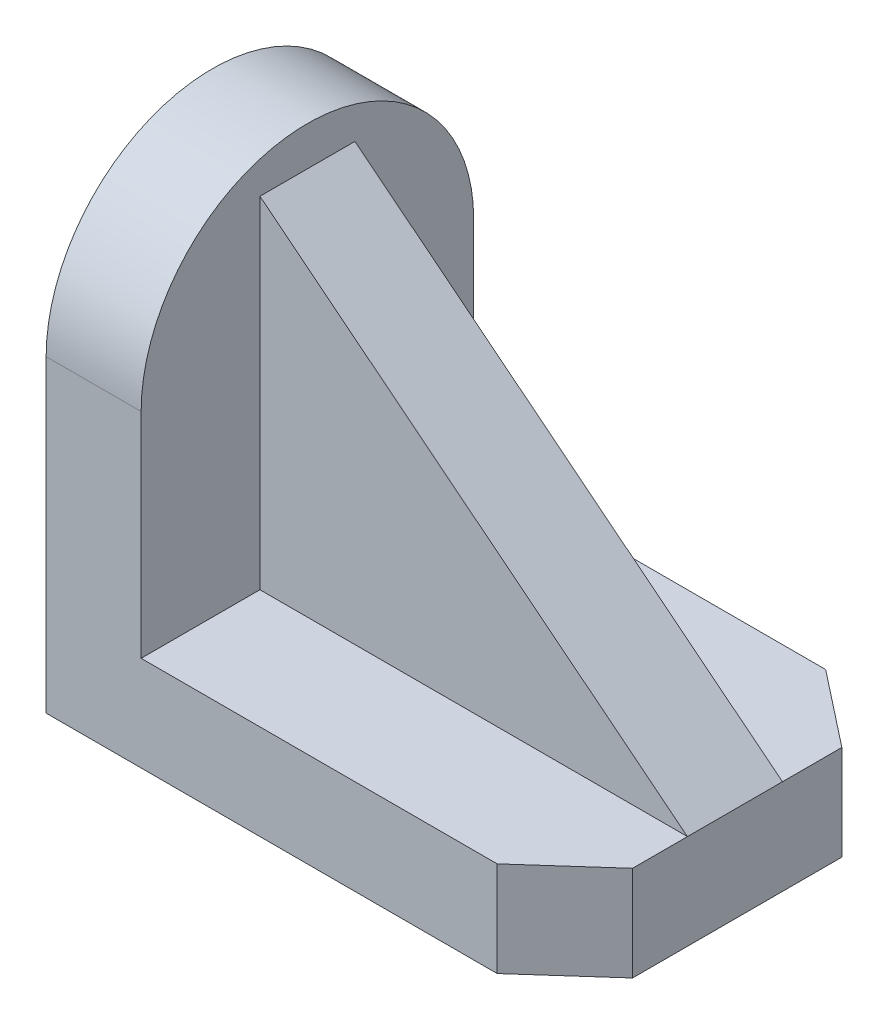
ISO-10303-21;
HEADER;
FILE_DESCRIPTION(('STEP AP214'),'2;1');
FILE_NAME('part.step','',(''),(''),'','','');
FILE_SCHEMA(('AUTOMOTIVE_DESIGN { 1 0 10303 214 1 1 1 1 }'));
ENDSEC;
DATA;
#1=APPLICATION_CONTEXT('core data for automotive mechanical design processes');
#2=APPLICATION_PROTOCOL_DEFINITION('international standard','automotive_design',2000,#1);
#3=PRODUCT_CONTEXT('',#1,'mechanical');
#4=PRODUCT('Part','Part','',(#3));
#5=PRODUCT_RELATED_PRODUCT_CATEGORY('part','',(#4));
#6=PRODUCT_DEFINITION_FORMATION('','',#4);
#7=PRODUCT_DEFINITION_CONTEXT('part definition',#1,'design');
#8=PRODUCT_DEFINITION('design','',#6,#7);
#9=PRODUCT_DEFINITION_SHAPE('','',#8);
#10=(LENGTH_UNIT() NAMED_UNIT(*) SI_UNIT(.MILLI.,.METRE.));
#11=(NAMED_UNIT(*) PLANE_ANGLE_UNIT() SI_UNIT($,.RADIAN.));
#12=(NAMED_UNIT(*) SI_UNIT($,.STERADIAN.) SOLID_ANGLE_UNIT());
#13=UNCERTAINTY_MEASURE_WITH_UNIT(LENGTH_MEASURE(1.E-05),#10,'distance_accuracy_value','');
#14=(GEOMETRIC_REPRESENTATION_CONTEXT(3) GLOBAL_UNCERTAINTY_ASSIGNED_CONTEXT((#13)) GLOBAL_UNIT_ASSIGNED_CONTEXT((#10,
#11,#12)) REPRESENTATION_CONTEXT('',''));
#15=CARTESIAN_POINT('',(0.,0.,0.));
#16=DIRECTION('',(0.,0.,1.));
#17=DIRECTION('',(1.,0.,0.));
#18=AXIS2_PLACEMENT_3D('',#15,#16,#17);
#19=CARTESIAN_POINT('',(0.,12.,0.));
#20=DIRECTION('',(0.,-1.,0.));
#21=DIRECTION('',(0.,0.,-1.));
#22=AXIS2_PLACEMENT_3D('',#19,#20,#21);
#23=PLANE('',#22);
#24=DIRECTION('',(1.,0.,0.));
#25=VECTOR('',#24,1.);
#26=CARTESIAN_POINT('',(-33.,12.,21.));
#27=LINE('',#26,#25);
#28=CARTESIAN_POINT('',(-21.,12.,21.));
#29=VERTEX_POINT('',#28);
#30=CARTESIAN_POINT('',(23.9653566140657,12.,21.));
#31=VERTEX_POINT('',#30);
#32=EDGE_CURVE('E159',#29,#31,#27,.T.);
#33=ORIENTED_EDGE('',*,*,#32,.T.);
#34=DIRECTION('',(-0.746037184688206,0.,0.665904286712809));
#35=VECTOR('',#34,1.);
#36=CARTESIAN_POINT('',(23.9653566140657,12.,21.));
#37=LINE('',#36,#35);
#38=CARTESIAN_POINT('',(33.,12.,12.9357803027881));
#39=VERTEX_POINT('',#38);
#40=EDGE_CURVE('E121',#39,#31,#37,.T.);
#41=ORIENTED_EDGE('',*,*,#40,.F.);
#42=DIRECTION('',(0.,0.,1.));
#43=VECTOR('',#42,1.);
#44=CARTESIAN_POINT('',(33.,12.,-21.));
#45=LINE('',#44,#43);
#46=CARTESIAN_POINT('',(33.,12.,6.));
#47=VERTEX_POINT('',#46);
#48=EDGE_CURVE('E130',#47,#39,#45,.T.);
#49=ORIENTED_EDGE('',*,*,#48,.F.);
#50=DIRECTION('',(1.,0.,0.));
#51=VECTOR('',#50,1.);
#52=CARTESIAN_POINT('',(33.,12.,6.));
#53=LINE('',#52,#51);
#54=CARTESIAN_POINT('',(-21.,12.,6.));
#55=VERTEX_POINT('',#54);
#56=EDGE_CURVE('E181',#55,#47,#53,.T.);
#57=ORIENTED_EDGE('',*,*,#56,.F.);
#58=DIRECTION('',(0.,0.,-1.));
#59=VECTOR('',#58,1.);
#60=CARTESIAN_POINT('',(-21.,12.,-21.));
#61=LINE('',#60,#59);
#62=EDGE_CURVE('E209',#29,#55,#61,.T.);
#63=ORIENTED_EDGE('',*,*,#62,.F.);
#64=EDGE_LOOP('',(#33,#41,#49,#57,#63));
#65=FACE_BOUND('',#64,.T.);
#66=ADVANCED_FACE('F33',(#65),#23,.F.);
#67=CARTESIAN_POINT('',(-21.,38.9950424980755,-21.));
#68=DIRECTION('',(-1.,0.,0.));
#69=DIRECTION('',(0.,0.,1.));
#70=AXIS2_PLACEMENT_3D('',#67,#68,#69);
#71=PLANE('',#70);
#72=DIRECTION('',(0.,-1.,0.));
#73=VECTOR('',#72,1.);
#74=CARTESIAN_POINT('',(-21.,12.,6.));
#75=LINE('',#74,#73);
#76=CARTESIAN_POINT('',(-21.,55.038969320595,6.));
#77=VERTEX_POINT('',#76);
#78=EDGE_CURVE('E187',#77,#55,#75,.T.);
#79=ORIENTED_EDGE('',*,*,#78,.F.);
#80=DIRECTION('',(0.,0.,-1.));
#81=VECTOR('',#80,1.);
#82=CARTESIAN_POINT('',(-21.,55.038969320595,6.));
#83=LINE('',#82,#81);
#84=CARTESIAN_POINT('',(-21.,55.038969320595,-6.));
#85=VERTEX_POINT('',#84);
#86=EDGE_CURVE('E189',#77,#85,#83,.T.);
#87=ORIENTED_EDGE('',*,*,#86,.T.);
#88=DIRECTION('',(0.,-1.,0.));
#89=VECTOR('',#88,1.);
#90=CARTESIAN_POINT('',(-21.,12.,-6.));
#91=LINE('',#90,#89);
#92=CARTESIAN_POINT('',(-21.,12.,-6.));
#93=VERTEX_POINT('',#92);
#94=EDGE_CURVE('E185',#85,#93,#91,.T.);
#95=ORIENTED_EDGE('',*,*,#94,.T.);
#96=CARTESIAN_POINT('',(-21.,12.,-21.));
#97=VERTEX_POINT('',#96);
#98=EDGE_CURVE('E204',#93,#97,#61,.T.);
#99=ORIENTED_EDGE('',*,*,#98,.T.);
#100=DIRECTION('',(0.,-1.,0.));
#101=VECTOR('',#100,1.);
#102=CARTESIAN_POINT('',(-21.,38.9950424980755,-21.));
#103=LINE('',#102,#101);
#104=CARTESIAN_POINT('',(-21.,38.9950424980755,-21.));
#105=VERTEX_POINT('',#104);
#106=EDGE_CURVE('E211',#105,#97,#103,.T.);
#107=ORIENTED_EDGE('',*,*,#106,.F.);
#108=CARTESIAN_POINT('',(-21.,38.9950424980755,0.));
#109=DIRECTION('',(1.,0.,0.));
#110=DIRECTION('',(0.,0.,-1.));
#111=AXIS2_PLACEMENT_3D('',#108,#109,#110);
#112=CIRCLE('',#111,21.);
#113=CARTESIAN_POINT('',(-21.,38.9950424980755,21.));
#114=VERTEX_POINT('',#113);
#115=EDGE_CURVE('E201',#105,#114,#112,.T.);
#116=ORIENTED_EDGE('',*,*,#115,.T.);
#117=DIRECTION('',(0.,-1.,0.));
#118=VECTOR('',#117,1.);
#119=CARTESIAN_POINT('',(-21.,38.9950424980755,21.));
#120=LINE('',#119,#118);
#121=EDGE_CURVE('E141',#114,#29,#120,.T.);
#122=ORIENTED_EDGE('',*,*,#121,.T.);
#123=ORIENTED_EDGE('',*,*,#62,.T.);
#124=EDGE_LOOP('',(#79,#87,#95,#99,#107,#116,#122,#123));
#125=FACE_BOUND('',#124,.T.);
#126=ADVANCED_FACE('F217',(#125),#71,.F.);
#127=CARTESIAN_POINT('',(33.,12.,-13.5));
#128=VERTEX_POINT('',#127);
#129=CARTESIAN_POINT('',(33.,12.,-6.));
#130=VERTEX_POINT('',#129);
#131=EDGE_CURVE('E155',#128,#130,#45,.T.);
#132=ORIENTED_EDGE('',*,*,#131,.F.);
#133=DIRECTION('',(0.786299748383108,0.,0.617845211758302));
#134=VECTOR('',#133,1.);
#135=CARTESIAN_POINT('',(33.,12.,-13.5));
#136=LINE('',#135,#134);
#137=CARTESIAN_POINT('',(23.4551366577875,12.,-21.));
#138=VERTEX_POINT('',#137);
#139=EDGE_CURVE('E178',#138,#128,#136,.T.);
#140=ORIENTED_EDGE('',*,*,#139,.F.);
#141=DIRECTION('',(1.,0.,0.));
#142=VECTOR('',#141,1.);
#143=CARTESIAN_POINT('',(-33.,12.,-21.));
#144=LINE('',#143,#142);
#145=EDGE_CURVE('E145',#97,#138,#144,.T.);
#146=ORIENTED_EDGE('',*,*,#145,.F.);
#147=ORIENTED_EDGE('',*,*,#98,.F.);
#148=DIRECTION('',(1.,0.,0.));
#149=VECTOR('',#148,1.);
#150=CARTESIAN_POINT('',(33.,12.,-6.));
#151=LINE('',#150,#149);
#152=EDGE_CURVE('E131',#93,#130,#151,.T.);
#153=ORIENTED_EDGE('',*,*,#152,.T.);
#154=EDGE_LOOP('',(#132,#140,#146,#147,#153));
#155=FACE_BOUND('',#154,.T.);
#156=ADVANCED_FACE('F229',(#155),#23,.F.);
#157=CARTESIAN_POINT('',(-33.,12.,-21.));
#158=DIRECTION('',(0.,0.,-1.));
#159=DIRECTION('',(-1.,0.,0.));
#160=AXIS2_PLACEMENT_3D('',#157,#158,#159);
#161=PLANE('',#160);
#162=DIRECTION('',(0.,1.,0.));
#163=VECTOR('',#162,1.);
#164=CARTESIAN_POINT('',(23.4551366577875,0.,-21.));
#165=LINE('',#164,#163);
#166=CARTESIAN_POINT('',(23.4551366577875,0.,-21.));
#167=VERTEX_POINT('',#166);
#168=EDGE_CURVE('E172',#167,#138,#165,.T.);
#169=ORIENTED_EDGE('',*,*,#168,.F.);
#170=DIRECTION('',(1.,0.,0.));
#171=VECTOR('',#170,1.);
#172=CARTESIAN_POINT('',(-33.,0.,-21.));
#173=LINE('',#172,#171);
#174=CARTESIAN_POINT('',(-33.,0.,-21.));
#175=VERTEX_POINT('',#174);
#176=EDGE_CURVE('E137',#175,#167,#173,.T.);
#177=ORIENTED_EDGE('',*,*,#176,.F.);
#178=DIRECTION('',(0.,-1.,0.));
#179=VECTOR('',#178,1.);
#180=CARTESIAN_POINT('',(-33.,12.,-21.));
#181=LINE('',#180,#179);
#182=CARTESIAN_POINT('',(-33.,38.9950424980755,-21.));
#183=VERTEX_POINT('',#182);
#184=EDGE_CURVE('E11',#183,#175,#181,.T.);
#185=ORIENTED_EDGE('',*,*,#184,.F.);
#186=DIRECTION('',(-1.,0.,0.));
#187=VECTOR('',#186,1.);
#188=CARTESIAN_POINT('',(-33.,38.9950424980755,-21.));
#189=LINE('',#188,#187);
#190=EDGE_CURVE('E208',#105,#183,#189,.T.);
#191=ORIENTED_EDGE('',*,*,#190,.F.);
#192=ORIENTED_EDGE('',*,*,#106,.T.);
#193=ORIENTED_EDGE('',*,*,#145,.T.);
#194=EDGE_LOOP('',(#169,#177,#185,#191,#192,#193));
#195=FACE_BOUND('',#194,.T.);
#196=ADVANCED_FACE('F35',(#195),#161,.T.);
#197=CARTESIAN_POINT('',(-33.,12.,-21.));
#198=DIRECTION('',(1.,0.,0.));
#199=DIRECTION('',(0.,0.,-1.));
#200=AXIS2_PLACEMENT_3D('',#197,#198,#199);
#201=PLANE('',#200);
#202=DIRECTION('',(0.,-1.,0.));
#203=VECTOR('',#202,1.);
#204=CARTESIAN_POINT('',(-33.,12.,21.));
#205=LINE('',#204,#203);
#206=CARTESIAN_POINT('',(-33.,38.9950424980755,21.));
#207=VERTEX_POINT('',#206);
#208=CARTESIAN_POINT('',(-33.,0.,21.));
#209=VERTEX_POINT('',#208);
#210=EDGE_CURVE('E37',#207,#209,#205,.T.);
#211=ORIENTED_EDGE('',*,*,#210,.F.);
#212=CARTESIAN_POINT('',(-33.,38.9950424980755,0.));
#213=DIRECTION('',(1.,0.,0.));
#214=DIRECTION('',(0.,0.,-1.));
#215=AXIS2_PLACEMENT_3D('',#212,#213,#214);
#216=CIRCLE('',#215,21.);
#217=EDGE_CURVE('E202',#183,#207,#216,.T.);
#218=ORIENTED_EDGE('',*,*,#217,.F.);
#219=ORIENTED_EDGE('',*,*,#184,.T.);
#220=DIRECTION('',(0.,0.,1.));
#221=VECTOR('',#220,1.);
#222=CARTESIAN_POINT('',(-33.,0.,-21.));
#223=LINE('',#222,#221);
#224=EDGE_CURVE('E139',#175,#209,#223,.T.);
#225=ORIENTED_EDGE('',*,*,#224,.T.);
#226=EDGE_LOOP('',(#211,#218,#219,#225));
#227=FACE_BOUND('',#226,.T.);
#228=ADVANCED_FACE('F221',(#227),#201,.F.);
#229=CARTESIAN_POINT('',(-33.,12.,21.));
#230=DIRECTION('',(0.,0.,-1.));
#231=DIRECTION('',(-1.,0.,0.));
#232=AXIS2_PLACEMENT_3D('',#229,#230,#231);
#233=PLANE('',#232);
#234=DIRECTION('',(1.,0.,0.));
#235=VECTOR('',#234,1.);
#236=CARTESIAN_POINT('',(-33.,0.,21.));
#237=LINE('',#236,#235);
#238=CARTESIAN_POINT('',(23.9653566140657,0.,21.));
#239=VERTEX_POINT('',#238);
#240=EDGE_CURVE('E136',#209,#239,#237,.T.);
#241=ORIENTED_EDGE('',*,*,#240,.T.);
#242=DIRECTION('',(0.,1.,0.));
#243=VECTOR('',#242,1.);
#244=CARTESIAN_POINT('',(23.9653566140657,0.,21.));
#245=LINE('',#244,#243);
#246=EDGE_CURVE('E48',#239,#31,#245,.T.);
#247=ORIENTED_EDGE('',*,*,#246,.T.);
#248=ORIENTED_EDGE('',*,*,#32,.F.);
#249=ORIENTED_EDGE('',*,*,#121,.F.);
#250=DIRECTION('',(1.,0.,0.));
#251=VECTOR('',#250,1.);
#252=CARTESIAN_POINT('',(-33.,38.9950424980755,21.));
#253=LINE('',#252,#251);
#254=EDGE_CURVE('E167',#207,#114,#253,.T.);
#255=ORIENTED_EDGE('',*,*,#254,.F.);
#256=ORIENTED_EDGE('',*,*,#210,.T.);
#257=EDGE_LOOP('',(#241,#247,#248,#249,#255,#256));
#258=FACE_BOUND('',#257,.T.);
#259=ADVANCED_FACE('F165',(#258),#233,.F.);
#260=CARTESIAN_POINT('',(33.,12.,-21.));
#261=DIRECTION('',(1.,0.,0.));
#262=DIRECTION('',(0.,0.,-1.));
#263=AXIS2_PLACEMENT_3D('',#260,#261,#262);
#264=PLANE('',#263);
#265=DIRECTION('',(0.,1.,0.));
#266=VECTOR('',#265,1.);
#267=CARTESIAN_POINT('',(33.,0.,12.9357803027881));
#268=LINE('',#267,#266);
#269=CARTESIAN_POINT('',(33.,0.,12.9357803027881));
#270=VERTEX_POINT('',#269);
#271=EDGE_CURVE('E115',#270,#39,#268,.T.);
#272=ORIENTED_EDGE('',*,*,#271,.F.);
#273=DIRECTION('',(0.,0.,1.));
#274=VECTOR('',#273,1.);
#275=CARTESIAN_POINT('',(33.,0.,-21.));
#276=LINE('',#275,#274);
#277=CARTESIAN_POINT('',(33.,0.,-13.5));
#278=VERTEX_POINT('',#277);
#279=EDGE_CURVE('E127',#278,#270,#276,.T.);
#280=ORIENTED_EDGE('',*,*,#279,.F.);
#281=DIRECTION('',(0.,1.,0.));
#282=VECTOR('',#281,1.);
#283=CARTESIAN_POINT('',(33.,0.,-13.5));
#284=LINE('',#283,#282);
#285=EDGE_CURVE('E56',#278,#128,#284,.T.);
#286=ORIENTED_EDGE('',*,*,#285,.T.);
#287=ORIENTED_EDGE('',*,*,#131,.T.);
#288=DIRECTION('',(0.,0.,-1.));
#289=VECTOR('',#288,1.);
#290=CARTESIAN_POINT('',(33.,12.,6.));
#291=LINE('',#290,#289);
#292=EDGE_CURVE('E198',#47,#130,#291,.T.);
#293=ORIENTED_EDGE('',*,*,#292,.F.);
#294=ORIENTED_EDGE('',*,*,#48,.T.);
#295=EDGE_LOOP('',(#272,#280,#286,#287,#293,#294));
#296=FACE_BOUND('',#295,.T.);
#297=ADVANCED_FACE('F126',(#296),#264,.T.);
#298=CARTESIAN_POINT('',(0.,0.,0.));
#299=DIRECTION('',(0.,-1.,0.));
#300=DIRECTION('',(0.,0.,-1.));
#301=AXIS2_PLACEMENT_3D('',#298,#299,#300);
#302=PLANE('',#301);
#303=DIRECTION('',(-0.746037184688206,0.,0.665904286712809));
#304=VECTOR('',#303,1.);
#305=CARTESIAN_POINT('',(23.9653566140657,0.,21.));
#306=LINE('',#305,#304);
#307=EDGE_CURVE('E112',#270,#239,#306,.T.);
#308=ORIENTED_EDGE('',*,*,#307,.T.);
#309=ORIENTED_EDGE('',*,*,#240,.F.);
#310=ORIENTED_EDGE('',*,*,#224,.F.);
#311=ORIENTED_EDGE('',*,*,#176,.T.);
#312=DIRECTION('',(0.786299748383108,0.,0.617845211758302));
#313=VECTOR('',#312,1.);
#314=CARTESIAN_POINT('',(33.,0.,-13.5));
#315=LINE('',#314,#313);
#316=EDGE_CURVE('E135',#167,#278,#315,.T.);
#317=ORIENTED_EDGE('',*,*,#316,.T.);
#318=ORIENTED_EDGE('',*,*,#279,.T.);
#319=EDGE_LOOP('',(#308,#309,#310,#311,#317,#318));
#320=FACE_BOUND('',#319,.T.);
#321=ADVANCED_FACE('F133',(#320),#302,.T.);
#322=CARTESIAN_POINT('',(-33.,38.9950424980755,0.));
#323=DIRECTION('',(1.,0.,0.));
#324=DIRECTION('',(0.,0.,-1.));
#325=AXIS2_PLACEMENT_3D('',#322,#323,#324);
#326=CYLINDRICAL_SURFACE('',#325,21.);
#327=ORIENTED_EDGE('',*,*,#217,.T.);
#328=ORIENTED_EDGE('',*,*,#254,.T.);
#329=ORIENTED_EDGE('',*,*,#115,.F.);
#330=ORIENTED_EDGE('',*,*,#190,.T.);
#331=EDGE_LOOP('',(#327,#328,#329,#330));
#332=FACE_BOUND('',#331,.T.);
#333=ADVANCED_FACE('F220',(#332),#326,.T.);
#334=CARTESIAN_POINT('',(-21.,55.038969320595,6.));
#335=DIRECTION('',(-0.623272074084412,-0.782005064987763,0.));
#336=DIRECTION('',(0.782005064987763,-0.623272074084412,0.));
#337=AXIS2_PLACEMENT_3D('',#334,#335,#336);
#338=PLANE('',#337);
#339=DIRECTION('',(-0.782005064987763,0.623272074084412,0.));
#340=VECTOR('',#339,1.);
#341=CARTESIAN_POINT('',(-21.,55.038969320595,-6.));
#342=LINE('',#341,#340);
#343=EDGE_CURVE('E192',#130,#85,#342,.T.);
#344=ORIENTED_EDGE('',*,*,#343,.T.);
#345=ORIENTED_EDGE('',*,*,#86,.F.);
#346=DIRECTION('',(-0.782005064987763,0.623272074084412,0.));
#347=VECTOR('',#346,1.);
#348=CARTESIAN_POINT('',(-21.,55.038969320595,6.));
#349=LINE('',#348,#347);
#350=EDGE_CURVE('E184',#47,#77,#349,.T.);
#351=ORIENTED_EDGE('',*,*,#350,.F.);
#352=ORIENTED_EDGE('',*,*,#292,.T.);
#353=EDGE_LOOP('',(#344,#345,#351,#352));
#354=FACE_BOUND('',#353,.T.);
#355=ADVANCED_FACE('F249',(#354),#338,.F.);
#356=CARTESIAN_POINT('',(0.,0.,6.));
#357=DIRECTION('',(0.,0.,-1.));
#358=DIRECTION('',(-1.,0.,0.));
#359=AXIS2_PLACEMENT_3D('',#356,#357,#358);
#360=PLANE('',#359);
#361=ORIENTED_EDGE('',*,*,#56,.T.);
#362=ORIENTED_EDGE('',*,*,#350,.T.);
#363=ORIENTED_EDGE('',*,*,#78,.T.);
#364=EDGE_LOOP('',(#361,#362,#363));
#365=FACE_BOUND('',#364,.T.);
#366=ADVANCED_FACE('F252',(#365),#360,.F.);
#367=CARTESIAN_POINT('',(0.,0.,-6.));
#368=DIRECTION('',(0.,0.,-1.));
#369=DIRECTION('',(-1.,0.,0.));
#370=AXIS2_PLACEMENT_3D('',#367,#368,#369);
#371=PLANE('',#370);
#372=ORIENTED_EDGE('',*,*,#152,.F.);
#373=ORIENTED_EDGE('',*,*,#94,.F.);
#374=ORIENTED_EDGE('',*,*,#343,.F.);
#375=EDGE_LOOP('',(#372,#373,#374));
#376=FACE_BOUND('',#375,.T.);
#377=ADVANCED_FACE('F246',(#376),#371,.T.);
#378=CARTESIAN_POINT('',(33.,0.,-13.5));
#379=DIRECTION('',(-0.617845211758302,0.,0.786299748383108));
#380=DIRECTION('',(0.786299748383108,0.,0.617845211758302));
#381=AXIS2_PLACEMENT_3D('',#378,#379,#380);
#382=PLANE('',#381);
#383=ORIENTED_EDGE('',*,*,#139,.T.);
#384=ORIENTED_EDGE('',*,*,#285,.F.);
#385=ORIENTED_EDGE('',*,*,#316,.F.);
#386=ORIENTED_EDGE('',*,*,#168,.T.);
#387=EDGE_LOOP('',(#383,#384,#385,#386));
#388=FACE_BOUND('',#387,.T.);
#389=ADVANCED_FACE('F254',(#388),#382,.F.);
#390=CARTESIAN_POINT('',(23.9653566140657,0.,21.));
#391=DIRECTION('',(-0.66590428671281,0.,-0.746037184688206));
#392=DIRECTION('',(-0.746037184688206,0.,0.66590428671281));
#393=AXIS2_PLACEMENT_3D('',#390,#391,#392);
#394=PLANE('',#393);
#395=ORIENTED_EDGE('',*,*,#40,.T.);
#396=ORIENTED_EDGE('',*,*,#246,.F.);
#397=ORIENTED_EDGE('',*,*,#307,.F.);
#398=ORIENTED_EDGE('',*,*,#271,.T.);
#399=EDGE_LOOP('',(#395,#396,#397,#398));
#400=FACE_BOUND('',#399,.T.);
#401=ADVANCED_FACE('F114',(#400),#394,.F.);
#402=CLOSED_SHELL('',(#66,#126,#156,#196,#228,#259,#297,#321,#333,#355,#366,#377,#389,#401));
#403=MANIFOLD_SOLID_BREP('B2',#402);
#404=ADVANCED_BREP_SHAPE_REPRESENTATION('',(#18,#403),#14);
#405=SHAPE_DEFINITION_REPRESENTATION(#9,#404);
ENDSEC;
END-ISO-10303-21;
